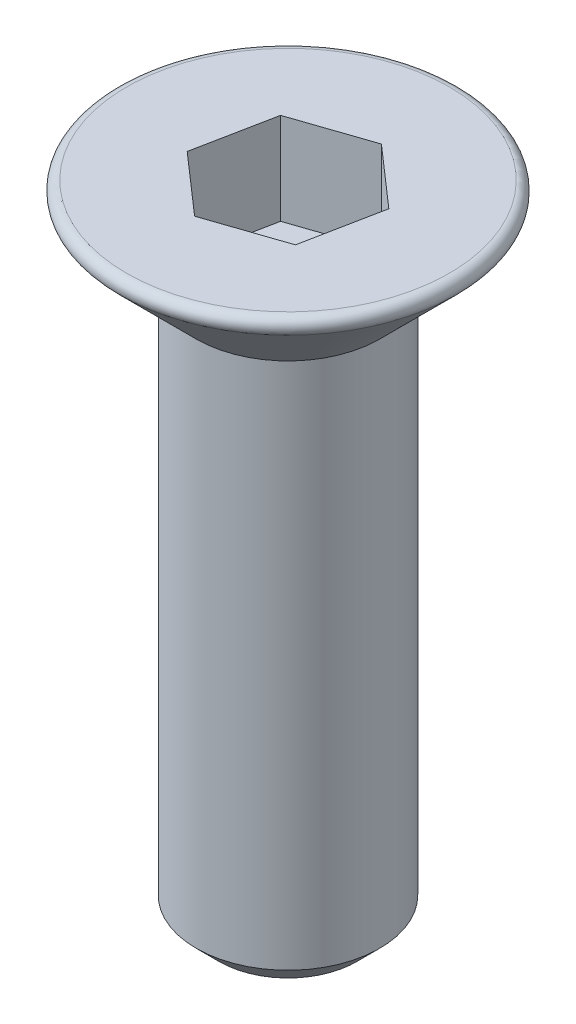
ISO-10303-21;
HEADER;
FILE_DESCRIPTION(('STEP AP214'),'2;1');
FILE_NAME('part.step','',(''),(''),'','','');
FILE_SCHEMA(('AUTOMOTIVE_DESIGN { 1 0 10303 214 1 1 1 1 }'));
ENDSEC;
DATA;
#1=APPLICATION_CONTEXT('core data for automotive mechanical design processes');
#2=APPLICATION_PROTOCOL_DEFINITION('international standard','automotive_design',2000,#1);
#3=PRODUCT_CONTEXT('',#1,'mechanical');
#4=PRODUCT('Part','Part','',(#3));
#5=PRODUCT_RELATED_PRODUCT_CATEGORY('part','',(#4));
#6=PRODUCT_DEFINITION_FORMATION('','',#4);
#7=PRODUCT_DEFINITION_CONTEXT('part definition',#1,'design');
#8=PRODUCT_DEFINITION('design','',#6,#7);
#9=PRODUCT_DEFINITION_SHAPE('','',#8);
#10=(LENGTH_UNIT() NAMED_UNIT(*) SI_UNIT(.MILLI.,.METRE.));
#11=(NAMED_UNIT(*) PLANE_ANGLE_UNIT() SI_UNIT($,.RADIAN.));
#12=(NAMED_UNIT(*) SI_UNIT($,.STERADIAN.) SOLID_ANGLE_UNIT());
#13=UNCERTAINTY_MEASURE_WITH_UNIT(LENGTH_MEASURE(1.E-05),#10,'distance_accuracy_value','');
#14=(GEOMETRIC_REPRESENTATION_CONTEXT(3) GLOBAL_UNCERTAINTY_ASSIGNED_CONTEXT((#13)) GLOBAL_UNIT_ASSIGNED_CONTEXT((#10,
#11,#12)) REPRESENTATION_CONTEXT('',''));
#15=CARTESIAN_POINT('',(0.,0.,0.));
#16=DIRECTION('',(0.,0.,1.));
#17=DIRECTION('',(1.,0.,0.));
#18=AXIS2_PLACEMENT_3D('',#15,#16,#17);
#19=CARTESIAN_POINT('',(0.,-12.,0.));
#20=DIRECTION('',(0.,1.,0.));
#21=DIRECTION('',(0.,0.,1.));
#22=AXIS2_PLACEMENT_3D('',#19,#20,#21);
#23=CYLINDRICAL_SURFACE('',#22,2.);
#24=CARTESIAN_POINT('',(0.,-11.5,0.));
#25=DIRECTION('',(0.,1.,0.));
#26=DIRECTION('',(0.,0.,1.));
#27=AXIS2_PLACEMENT_3D('',#24,#25,#26);
#28=CIRCLE('',#27,2.);
#29=CARTESIAN_POINT('',(0.,-11.5,2.));
#30=VERTEX_POINT('',#29);
#31=EDGE_CURVE('E44',#30,#30,#28,.T.);
#32=ORIENTED_EDGE('',*,*,#31,.T.);
#33=EDGE_LOOP('',(#32));
#34=FACE_BOUND('',#33,.T.);
#35=CARTESIAN_POINT('',(0.,0.,0.));
#36=DIRECTION('',(0.,1.,0.));
#37=DIRECTION('',(0.,0.,1.));
#38=AXIS2_PLACEMENT_3D('',#35,#36,#37);
#39=CIRCLE('',#38,2.);
#40=CARTESIAN_POINT('',(0.,0.,2.));
#41=VERTEX_POINT('',#40);
#42=EDGE_CURVE('E149',#41,#41,#39,.T.);
#43=ORIENTED_EDGE('',*,*,#42,.F.);
#44=EDGE_LOOP('',(#43));
#45=FACE_BOUND('',#44,.T.);
#46=ADVANCED_FACE('F36',(#34,#45),#23,.T.);
#47=CARTESIAN_POINT('',(0.,-12.,0.));
#48=DIRECTION('',(0.,1.,0.));
#49=DIRECTION('',(0.,0.,1.));
#50=AXIS2_PLACEMENT_3D('',#47,#48,#49);
#51=PLANE('',#50);
#52=CARTESIAN_POINT('',(0.,-12.,0.));
#53=DIRECTION('',(0.,1.,0.));
#54=DIRECTION('',(0.,0.,1.));
#55=AXIS2_PLACEMENT_3D('',#52,#53,#54);
#56=CIRCLE('',#55,1.5);
#57=CARTESIAN_POINT('',(0.,-12.,1.5));
#58=VERTEX_POINT('',#57);
#59=EDGE_CURVE('E11',#58,#58,#56,.F.);
#60=ORIENTED_EDGE('',*,*,#59,.T.);
#61=EDGE_LOOP('',(#60));
#62=FACE_BOUND('',#61,.T.);
#63=ADVANCED_FACE('F171',(#62),#51,.F.);
#64=CARTESIAN_POINT('',(0.,1.65857864376268,0.));
#65=DIRECTION('',(0.,1.,0.));
#66=DIRECTION('',(0.,0.,1.));
#67=AXIS2_PLACEMENT_3D('',#64,#65,#66);
#68=CONICAL_SURFACE('',#67,3.65857864376269,0.78539816339745);
#69=ORIENTED_EDGE('',*,*,#42,.T.);
#70=EDGE_LOOP('',(#69));
#71=FACE_BOUND('',#70,.T.);
#72=CARTESIAN_POINT('',(0.,1.65857864376268,0.));
#73=DIRECTION('',(0.,-1.,0.));
#74=DIRECTION('',(0.,0.,-1.));
#75=AXIS2_PLACEMENT_3D('',#72,#73,#74);
#76=CIRCLE('',#75,3.65857864376269);
#77=CARTESIAN_POINT('',(0.,1.65857864376268,-3.65857864376269));
#78=VERTEX_POINT('',#77);
#79=EDGE_CURVE('E146',#78,#78,#76,.T.);
#80=ORIENTED_EDGE('',*,*,#79,.T.);
#81=EDGE_LOOP('',(#80));
#82=FACE_BOUND('',#81,.T.);
#83=ADVANCED_FACE('F175',(#71,#82),#68,.T.);
#84=CARTESIAN_POINT('',(0.,1.79999999999999,0.));
#85=DIRECTION('',(0.,-1.,0.));
#86=DIRECTION('',(0.,0.,-1.));
#87=AXIS2_PLACEMENT_3D('',#84,#85,#86);
#88=TOROIDAL_SURFACE('',#87,3.51715728752538,0.2);
#89=ORIENTED_EDGE('',*,*,#79,.F.);
#90=EDGE_LOOP('',(#89));
#91=FACE_BOUND('',#90,.T.);
#92=CARTESIAN_POINT('',(0.,1.99999999999999,0.));
#93=DIRECTION('',(0.,-1.,0.));
#94=DIRECTION('',(0.,0.,-1.));
#95=AXIS2_PLACEMENT_3D('',#92,#93,#94);
#96=CIRCLE('',#95,3.51715728752538);
#97=CARTESIAN_POINT('',(0.,1.99999999999999,-3.51715728752538));
#98=VERTEX_POINT('',#97);
#99=EDGE_CURVE('E138',#98,#98,#96,.T.);
#100=ORIENTED_EDGE('',*,*,#99,.T.);
#101=EDGE_LOOP('',(#100));
#102=FACE_BOUND('',#101,.T.);
#103=ADVANCED_FACE('F166',(#91,#102),#88,.T.);
#104=CARTESIAN_POINT('',(-3.51715728752538,1.99999999999999,0.));
#105=DIRECTION('',(0.,-1.,0.));
#106=DIRECTION('',(0.,0.,-1.));
#107=AXIS2_PLACEMENT_3D('',#104,#105,#106);
#108=PLANE('',#107);
#109=DIRECTION('',(0.194350676916494,0.,-0.980932115073261));
#110=VECTOR('',#109,1.);
#111=CARTESIAN_POINT('',(1.30308554915751,1.99999999999999,1.14103814641618));
#112=LINE('',#111,#110);
#113=CARTESIAN_POINT('',(1.3030855491575,1.99999999999999,1.14103814641618));
#114=VERTEX_POINT('',#113);
#115=CARTESIAN_POINT('',(1.63971079606228,1.99999999999999,-0.557986115666704));
#116=VERTEX_POINT('',#115);
#117=EDGE_CURVE('E125',#114,#116,#112,.T.);
#118=ORIENTED_EDGE('',*,*,#117,.F.);
#119=DIRECTION('',(0.946687469499691,0.,-0.322153434084245));
#120=VECTOR('',#119,1.);
#121=CARTESIAN_POINT('',(-0.336625246904771,1.99999999999999,1.69902426208289));
#122=LINE('',#121,#120);
#123=CARTESIAN_POINT('',(-0.336625246904771,1.99999999999999,1.69902426208289));
#124=VERTEX_POINT('',#123);
#125=EDGE_CURVE('E51',#124,#114,#122,.T.);
#126=ORIENTED_EDGE('',*,*,#125,.F.);
#127=DIRECTION('',(0.752336792583197,0.,0.658778680989016));
#128=VECTOR('',#127,1.);
#129=CARTESIAN_POINT('',(-1.63971079606228,1.99999999999999,0.557986115666704));
#130=LINE('',#129,#128);
#131=CARTESIAN_POINT('',(-1.63971079606228,1.99999999999999,0.557986115666704));
#132=VERTEX_POINT('',#131);
#133=EDGE_CURVE('E134',#132,#124,#130,.T.);
#134=ORIENTED_EDGE('',*,*,#133,.F.);
#135=DIRECTION('',(-0.194350676916494,0.,0.980932115073261));
#136=VECTOR('',#135,1.);
#137=CARTESIAN_POINT('',(-1.3030855491575,1.99999999999999,-1.14103814641619));
#138=LINE('',#137,#136);
#139=CARTESIAN_POINT('',(-1.3030855491575,1.99999999999999,-1.14103814641619));
#140=VERTEX_POINT('',#139);
#141=EDGE_CURVE('E132',#140,#132,#138,.T.);
#142=ORIENTED_EDGE('',*,*,#141,.F.);
#143=DIRECTION('',(-0.946687469499691,0.,0.322153434084245));
#144=VECTOR('',#143,1.);
#145=CARTESIAN_POINT('',(0.336625246904771,1.99999999999999,-1.69902426208289));
#146=LINE('',#145,#144);
#147=CARTESIAN_POINT('',(0.336625246904771,1.99999999999999,-1.69902426208289));
#148=VERTEX_POINT('',#147);
#149=EDGE_CURVE('E99',#148,#140,#146,.T.);
#150=ORIENTED_EDGE('',*,*,#149,.F.);
#151=DIRECTION('',(-0.752336792583197,0.,-0.658778680989016));
#152=VECTOR('',#151,1.);
#153=CARTESIAN_POINT('',(1.63971079606228,1.99999999999999,-0.557986115666704));
#154=LINE('',#153,#152);
#155=EDGE_CURVE('E128',#116,#148,#154,.T.);
#156=ORIENTED_EDGE('',*,*,#155,.F.);
#157=EDGE_LOOP('',(#118,#126,#134,#142,#150,#156));
#158=FACE_BOUND('',#157,.T.);
#159=ORIENTED_EDGE('',*,*,#99,.F.);
#160=EDGE_LOOP('',(#159));
#161=FACE_BOUND('',#160,.T.);
#162=ADVANCED_FACE('F158',(#158,#161),#108,.F.);
#163=CARTESIAN_POINT('',(0.,-11.5,0.));
#164=DIRECTION('',(0.,1.,0.));
#165=DIRECTION('',(0.,0.,1.));
#166=AXIS2_PLACEMENT_3D('',#163,#164,#165);
#167=CONICAL_SURFACE('',#166,2.,0.785398163397448);
#168=ORIENTED_EDGE('',*,*,#59,.F.);
#169=EDGE_LOOP('',(#168));
#170=FACE_BOUND('',#169,.T.);
#171=ORIENTED_EDGE('',*,*,#31,.F.);
#172=EDGE_LOOP('',(#171));
#173=FACE_BOUND('',#172,.T.);
#174=ADVANCED_FACE('F38',(#170,#173),#167,.T.);
#175=CARTESIAN_POINT('',(-0.336625246904771,0.,1.69902426208289));
#176=DIRECTION('',(0.322153434084245,0.,0.946687469499691));
#177=DIRECTION('',(0.946687469499691,0.,-0.322153434084245));
#178=AXIS2_PLACEMENT_3D('',#175,#176,#177);
#179=PLANE('',#178);
#180=ORIENTED_EDGE('',*,*,#125,.T.);
#181=DIRECTION('',(0.,1.,0.));
#182=VECTOR('',#181,1.);
#183=CARTESIAN_POINT('',(1.30308554915751,0.,1.14103814641618));
#184=LINE('',#183,#182);
#185=CARTESIAN_POINT('',(1.30308554915751,0.,1.14103814641618));
#186=VERTEX_POINT('',#185);
#187=EDGE_CURVE('E81',#186,#114,#184,.T.);
#188=ORIENTED_EDGE('',*,*,#187,.F.);
#189=DIRECTION('',(0.946687469499691,0.,-0.322153434084245));
#190=VECTOR('',#189,1.);
#191=CARTESIAN_POINT('',(-0.336625246904771,0.,1.69902426208289));
#192=LINE('',#191,#190);
#193=CARTESIAN_POINT('',(-0.336625246904771,0.,1.69902426208289));
#194=VERTEX_POINT('',#193);
#195=EDGE_CURVE('E136',#194,#186,#192,.T.);
#196=ORIENTED_EDGE('',*,*,#195,.F.);
#197=DIRECTION('',(0.,1.,0.));
#198=VECTOR('',#197,1.);
#199=CARTESIAN_POINT('',(-0.336625246904771,0.,1.69902426208289));
#200=LINE('',#199,#198);
#201=EDGE_CURVE('E59',#194,#124,#200,.T.);
#202=ORIENTED_EDGE('',*,*,#201,.T.);
#203=EDGE_LOOP('',(#180,#188,#196,#202));
#204=FACE_BOUND('',#203,.T.);
#205=ADVANCED_FACE('F157',(#204),#179,.F.);
#206=CARTESIAN_POINT('',(-1.63971079606228,0.,0.557986115666704));
#207=DIRECTION('',(-0.658778680989016,0.,0.752336792583197));
#208=DIRECTION('',(0.752336792583197,0.,0.658778680989016));
#209=AXIS2_PLACEMENT_3D('',#206,#207,#208);
#210=PLANE('',#209);
#211=ORIENTED_EDGE('',*,*,#133,.T.);
#212=ORIENTED_EDGE('',*,*,#201,.F.);
#213=DIRECTION('',(0.752336792583197,0.,0.658778680989016));
#214=VECTOR('',#213,1.);
#215=CARTESIAN_POINT('',(-1.63971079606228,0.,0.557986115666704));
#216=LINE('',#215,#214);
#217=CARTESIAN_POINT('',(-1.63971079606228,0.,0.557986115666704));
#218=VERTEX_POINT('',#217);
#219=EDGE_CURVE('E111',#218,#194,#216,.T.);
#220=ORIENTED_EDGE('',*,*,#219,.F.);
#221=DIRECTION('',(0.,1.,0.));
#222=VECTOR('',#221,1.);
#223=CARTESIAN_POINT('',(-1.63971079606228,0.,0.557986115666704));
#224=LINE('',#223,#222);
#225=EDGE_CURVE('E103',#218,#132,#224,.T.);
#226=ORIENTED_EDGE('',*,*,#225,.T.);
#227=EDGE_LOOP('',(#211,#212,#220,#226));
#228=FACE_BOUND('',#227,.T.);
#229=ADVANCED_FACE('F164',(#228),#210,.F.);
#230=CARTESIAN_POINT('',(-1.3030855491575,0.,-1.14103814641619));
#231=DIRECTION('',(-0.980932115073261,0.,-0.194350676916494));
#232=DIRECTION('',(-0.194350676916494,0.,0.980932115073261));
#233=AXIS2_PLACEMENT_3D('',#230,#231,#232);
#234=PLANE('',#233);
#235=ORIENTED_EDGE('',*,*,#141,.T.);
#236=ORIENTED_EDGE('',*,*,#225,.F.);
#237=DIRECTION('',(-0.194350676916494,0.,0.980932115073261));
#238=VECTOR('',#237,1.);
#239=CARTESIAN_POINT('',(-1.3030855491575,0.,-1.14103814641619));
#240=LINE('',#239,#238);
#241=CARTESIAN_POINT('',(-1.3030855491575,0.,-1.14103814641619));
#242=VERTEX_POINT('',#241);
#243=EDGE_CURVE('E107',#242,#218,#240,.T.);
#244=ORIENTED_EDGE('',*,*,#243,.F.);
#245=DIRECTION('',(0.,1.,0.));
#246=VECTOR('',#245,1.);
#247=CARTESIAN_POINT('',(-1.3030855491575,0.,-1.14103814641619));
#248=LINE('',#247,#246);
#249=EDGE_CURVE('E92',#242,#140,#248,.T.);
#250=ORIENTED_EDGE('',*,*,#249,.T.);
#251=EDGE_LOOP('',(#235,#236,#244,#250));
#252=FACE_BOUND('',#251,.T.);
#253=ADVANCED_FACE('F108',(#252),#234,.F.);
#254=CARTESIAN_POINT('',(0.336625246904771,0.,-1.69902426208289));
#255=DIRECTION('',(-0.322153434084245,0.,-0.946687469499691));
#256=DIRECTION('',(-0.946687469499691,0.,0.322153434084245));
#257=AXIS2_PLACEMENT_3D('',#254,#255,#256);
#258=PLANE('',#257);
#259=ORIENTED_EDGE('',*,*,#149,.T.);
#260=ORIENTED_EDGE('',*,*,#249,.F.);
#261=DIRECTION('',(-0.946687469499691,0.,0.322153434084245));
#262=VECTOR('',#261,1.);
#263=CARTESIAN_POINT('',(0.336625246904771,0.,-1.69902426208289));
#264=LINE('',#263,#262);
#265=CARTESIAN_POINT('',(0.336625246904771,0.,-1.69902426208289));
#266=VERTEX_POINT('',#265);
#267=EDGE_CURVE('E96',#266,#242,#264,.T.);
#268=ORIENTED_EDGE('',*,*,#267,.F.);
#269=DIRECTION('',(0.,1.,0.));
#270=VECTOR('',#269,1.);
#271=CARTESIAN_POINT('',(0.336625246904771,0.,-1.69902426208289));
#272=LINE('',#271,#270);
#273=EDGE_CURVE('E104',#266,#148,#272,.T.);
#274=ORIENTED_EDGE('',*,*,#273,.T.);
#275=EDGE_LOOP('',(#259,#260,#268,#274));
#276=FACE_BOUND('',#275,.T.);
#277=ADVANCED_FACE('F94',(#276),#258,.F.);
#278=CARTESIAN_POINT('',(1.63971079606228,0.,-0.557986115666704));
#279=DIRECTION('',(0.658778680989016,0.,-0.752336792583197));
#280=DIRECTION('',(-0.752336792583197,0.,-0.658778680989016));
#281=AXIS2_PLACEMENT_3D('',#278,#279,#280);
#282=PLANE('',#281);
#283=ORIENTED_EDGE('',*,*,#155,.T.);
#284=ORIENTED_EDGE('',*,*,#273,.F.);
#285=DIRECTION('',(-0.752336792583197,0.,-0.658778680989016));
#286=VECTOR('',#285,1.);
#287=CARTESIAN_POINT('',(1.63971079606228,0.,-0.557986115666704));
#288=LINE('',#287,#286);
#289=CARTESIAN_POINT('',(1.63971079606228,0.,-0.557986115666704));
#290=VERTEX_POINT('',#289);
#291=EDGE_CURVE('E117',#290,#266,#288,.T.);
#292=ORIENTED_EDGE('',*,*,#291,.F.);
#293=DIRECTION('',(0.,1.,0.));
#294=VECTOR('',#293,1.);
#295=CARTESIAN_POINT('',(1.63971079606228,0.,-0.557986115666704));
#296=LINE('',#295,#294);
#297=EDGE_CURVE('E141',#290,#116,#296,.T.);
#298=ORIENTED_EDGE('',*,*,#297,.T.);
#299=EDGE_LOOP('',(#283,#284,#292,#298));
#300=FACE_BOUND('',#299,.T.);
#301=ADVANCED_FACE('F188',(#300),#282,.F.);
#302=CARTESIAN_POINT('',(1.30308554915751,0.,1.14103814641618));
#303=DIRECTION('',(0.980932115073261,0.,0.194350676916494));
#304=DIRECTION('',(0.194350676916494,0.,-0.980932115073261));
#305=AXIS2_PLACEMENT_3D('',#302,#303,#304);
#306=PLANE('',#305);
#307=ORIENTED_EDGE('',*,*,#117,.T.);
#308=ORIENTED_EDGE('',*,*,#297,.F.);
#309=DIRECTION('',(0.194350676916494,0.,-0.980932115073261));
#310=VECTOR('',#309,1.);
#311=CARTESIAN_POINT('',(1.30308554915751,0.,1.14103814641618));
#312=LINE('',#311,#310);
#313=EDGE_CURVE('E119',#186,#290,#312,.T.);
#314=ORIENTED_EDGE('',*,*,#313,.F.);
#315=ORIENTED_EDGE('',*,*,#187,.T.);
#316=EDGE_LOOP('',(#307,#308,#314,#315));
#317=FACE_BOUND('',#316,.T.);
#318=ADVANCED_FACE('F185',(#317),#306,.F.);
#319=CARTESIAN_POINT('',(0.,0.,0.));
#320=DIRECTION('',(0.,1.,0.));
#321=DIRECTION('',(0.,0.,1.));
#322=AXIS2_PLACEMENT_3D('',#319,#320,#321);
#323=PLANE('',#322);
#324=ORIENTED_EDGE('',*,*,#195,.T.);
#325=ORIENTED_EDGE('',*,*,#313,.T.);
#326=ORIENTED_EDGE('',*,*,#291,.T.);
#327=ORIENTED_EDGE('',*,*,#267,.T.);
#328=ORIENTED_EDGE('',*,*,#243,.T.);
#329=ORIENTED_EDGE('',*,*,#219,.T.);
#330=EDGE_LOOP('',(#324,#325,#326,#327,#328,#329));
#331=FACE_BOUND('',#330,.T.);
#332=ADVANCED_FACE('F114',(#331),#323,.T.);
#333=CLOSED_SHELL('',(#46,#63,#83,#103,#162,#174,#205,#229,#253,#277,#301,#318,#332));
#334=MANIFOLD_SOLID_BREP('B2',#333);
#335=ADVANCED_BREP_SHAPE_REPRESENTATION('',(#18,#334),#14);
#336=SHAPE_DEFINITION_REPRESENTATION(#9,#335);
ENDSEC;
END-ISO-10303-21;
